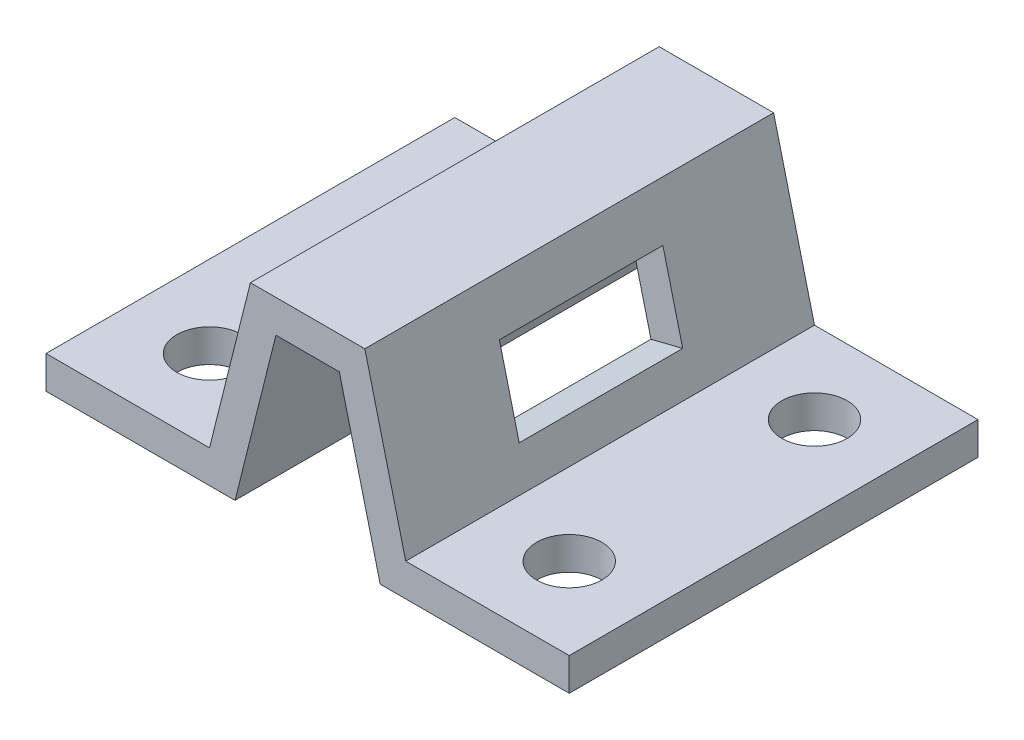
ISO-10303-21;
HEADER;
FILE_DESCRIPTION(('STEP AP214'),'2;1');
FILE_NAME('part.step','',(''),(''),'','','');
FILE_SCHEMA(('AUTOMOTIVE_DESIGN { 1 0 10303 214 1 1 1 1 }'));
ENDSEC;
DATA;
#1=APPLICATION_CONTEXT('core data for automotive mechanical design processes');
#2=APPLICATION_PROTOCOL_DEFINITION('international standard','automotive_design',2000,#1);
#3=PRODUCT_CONTEXT('',#1,'mechanical');
#4=PRODUCT('Part','Part','',(#3));
#5=PRODUCT_RELATED_PRODUCT_CATEGORY('part','',(#4));
#6=PRODUCT_DEFINITION_FORMATION('','',#4);
#7=PRODUCT_DEFINITION_CONTEXT('part definition',#1,'design');
#8=PRODUCT_DEFINITION('design','',#6,#7);
#9=PRODUCT_DEFINITION_SHAPE('','',#8);
#10=(LENGTH_UNIT() NAMED_UNIT(*) SI_UNIT(.MILLI.,.METRE.));
#11=(NAMED_UNIT(*) PLANE_ANGLE_UNIT() SI_UNIT($,.RADIAN.));
#12=(NAMED_UNIT(*) SI_UNIT($,.STERADIAN.) SOLID_ANGLE_UNIT());
#13=UNCERTAINTY_MEASURE_WITH_UNIT(LENGTH_MEASURE(1.E-05),#10,'distance_accuracy_value','');
#14=(GEOMETRIC_REPRESENTATION_CONTEXT(3) GLOBAL_UNCERTAINTY_ASSIGNED_CONTEXT((#13)) GLOBAL_UNIT_ASSIGNED_CONTEXT((#10,
#11,#12)) REPRESENTATION_CONTEXT('',''));
#15=CARTESIAN_POINT('',(0.,0.,0.));
#16=DIRECTION('',(0.,0.,1.));
#17=DIRECTION('',(1.,0.,0.));
#18=AXIS2_PLACEMENT_3D('',#15,#16,#17);
#19=CARTESIAN_POINT('',(-30.,9.99999999999998,62.5));
#20=DIRECTION('',(0.970142500145332,-0.242535625036333,0.));
#21=DIRECTION('',(0.242535625036333,0.970142500145332,0.));
#22=AXIS2_PLACEMENT_3D('',#19,#20,#21);
#23=PLANE('',#22);
#24=DIRECTION('',(0.,0.,-1.));
#25=VECTOR('',#24,1.);
#26=CARTESIAN_POINT('',(-21.138034375545,45.44786249782,-25.));
#27=LINE('',#26,#25);
#28=CARTESIAN_POINT('',(-21.138034375545,45.44786249782,25.));
#29=VERTEX_POINT('',#28);
#30=CARTESIAN_POINT('',(-21.138034375545,45.44786249782,-25.));
#31=VERTEX_POINT('',#30);
#32=EDGE_CURVE('E198',#29,#31,#27,.T.);
#33=ORIENTED_EDGE('',*,*,#32,.F.);
#34=DIRECTION('',(0.242535625036333,0.970142500145332,0.));
#35=VECTOR('',#34,1.);
#36=CARTESIAN_POINT('',(-21.138034375545,45.44786249782,25.));
#37=LINE('',#36,#35);
#38=CARTESIAN_POINT('',(-27.2014250014533,21.1942999941867,25.));
#39=VERTEX_POINT('',#38);
#40=EDGE_CURVE('E49',#39,#29,#37,.T.);
#41=ORIENTED_EDGE('',*,*,#40,.F.);
#42=DIRECTION('',(0.,0.,1.));
#43=VECTOR('',#42,1.);
#44=CARTESIAN_POINT('',(-27.2014250014533,21.1942999941867,-25.));
#45=LINE('',#44,#43);
#46=CARTESIAN_POINT('',(-27.2014250014533,21.1942999941867,-25.));
#47=VERTEX_POINT('',#46);
#48=EDGE_CURVE('E189',#47,#39,#45,.T.);
#49=ORIENTED_EDGE('',*,*,#48,.F.);
#50=DIRECTION('',(-0.242535625036333,-0.970142500145332,0.));
#51=VECTOR('',#50,1.);
#52=CARTESIAN_POINT('',(-21.138034375545,45.44786249782,-25.));
#53=LINE('',#52,#51);
#54=EDGE_CURVE('E192',#31,#47,#53,.T.);
#55=ORIENTED_EDGE('',*,*,#54,.F.);
#56=EDGE_LOOP('',(#33,#41,#49,#55));
#57=FACE_BOUND('',#56,.T.);
#58=DIRECTION('',(-0.242535625036333,-0.970142500145332,0.));
#59=VECTOR('',#58,1.);
#60=CARTESIAN_POINT('',(-30.,9.99999999999998,-62.5));
#61=LINE('',#60,#59);
#62=CARTESIAN_POINT('',(-17.5,60.,-62.5));
#63=VERTEX_POINT('',#62);
#64=CARTESIAN_POINT('',(-30.,9.99999999999998,-62.5));
#65=VERTEX_POINT('',#64);
#66=EDGE_CURVE('E258',#63,#65,#61,.T.);
#67=ORIENTED_EDGE('',*,*,#66,.T.);
#68=DIRECTION('',(0.,0.,-1.));
#69=VECTOR('',#68,1.);
#70=CARTESIAN_POINT('',(-30.,9.99999999999998,62.5));
#71=LINE('',#70,#69);
#72=CARTESIAN_POINT('',(-30.,9.99999999999998,62.5));
#73=VERTEX_POINT('',#72);
#74=EDGE_CURVE('E11',#73,#65,#71,.T.);
#75=ORIENTED_EDGE('',*,*,#74,.F.);
#76=DIRECTION('',(-0.242535625036333,-0.970142500145332,0.));
#77=VECTOR('',#76,1.);
#78=CARTESIAN_POINT('',(-30.,9.99999999999998,62.5));
#79=LINE('',#78,#77);
#80=CARTESIAN_POINT('',(-17.5,60.,62.5));
#81=VERTEX_POINT('',#80);
#82=EDGE_CURVE('E259',#81,#73,#79,.T.);
#83=ORIENTED_EDGE('',*,*,#82,.F.);
#84=DIRECTION('',(0.,0.,-1.));
#85=VECTOR('',#84,1.);
#86=CARTESIAN_POINT('',(-17.5,60.,62.5));
#87=LINE('',#86,#85);
#88=EDGE_CURVE('E285',#81,#63,#87,.T.);
#89=ORIENTED_EDGE('',*,*,#88,.T.);
#90=EDGE_LOOP('',(#67,#75,#83,#89));
#91=FACE_BOUND('',#90,.T.);
#92=ADVANCED_FACE('F33',(#57,#91),#23,.F.);
#93=CARTESIAN_POINT('',(-80.,10.,62.5));
#94=DIRECTION('',(0.,-1.,0.));
#95=DIRECTION('',(1.,0.,0.));
#96=AXIS2_PLACEMENT_3D('',#93,#94,#95);
#97=PLANE('',#96);
#98=CARTESIAN_POINT('',(-55.,9.99999999999997,-37.4999999999992));
#99=DIRECTION('',(0.,1.,0.));
#100=DIRECTION('',(-1.,0.,0.));
#101=AXIS2_PLACEMENT_3D('',#98,#99,#100);
#102=CIRCLE('',#101,9.99999999999999);
#103=CARTESIAN_POINT('',(-65.,9.99999999999997,-37.4999999999992));
#104=VERTEX_POINT('',#103);
#105=EDGE_CURVE('E240',#104,#104,#102,.T.);
#106=ORIENTED_EDGE('',*,*,#105,.F.);
#107=EDGE_LOOP('',(#106));
#108=FACE_BOUND('',#107,.T.);
#109=CARTESIAN_POINT('',(-55.,9.99999999999997,37.5000000000008));
#110=DIRECTION('',(0.,1.,0.));
#111=DIRECTION('',(-1.,0.,0.));
#112=AXIS2_PLACEMENT_3D('',#109,#110,#111);
#113=CIRCLE('',#112,9.99999999999999);
#114=CARTESIAN_POINT('',(-65.,9.99999999999997,37.5000000000008));
#115=VERTEX_POINT('',#114);
#116=EDGE_CURVE('E233',#115,#115,#113,.T.);
#117=ORIENTED_EDGE('',*,*,#116,.F.);
#118=EDGE_LOOP('',(#117));
#119=FACE_BOUND('',#118,.T.);
#120=DIRECTION('',(-1.,0.,0.));
#121=VECTOR('',#120,1.);
#122=CARTESIAN_POINT('',(-80.,10.,-62.5));
#123=LINE('',#122,#121);
#124=CARTESIAN_POINT('',(-80.,10.,-62.5));
#125=VERTEX_POINT('',#124);
#126=EDGE_CURVE('E288',#65,#125,#123,.T.);
#127=ORIENTED_EDGE('',*,*,#126,.T.);
#128=DIRECTION('',(0.,0.,-1.));
#129=VECTOR('',#128,1.);
#130=CARTESIAN_POINT('',(-80.,10.,62.5));
#131=LINE('',#130,#129);
#132=CARTESIAN_POINT('',(-80.,10.,62.5));
#133=VERTEX_POINT('',#132);
#134=EDGE_CURVE('E41',#133,#125,#131,.T.);
#135=ORIENTED_EDGE('',*,*,#134,.F.);
#136=DIRECTION('',(-1.,0.,0.));
#137=VECTOR('',#136,1.);
#138=CARTESIAN_POINT('',(-80.,10.,62.5));
#139=LINE('',#138,#137);
#140=EDGE_CURVE('E262',#73,#133,#139,.T.);
#141=ORIENTED_EDGE('',*,*,#140,.F.);
#142=ORIENTED_EDGE('',*,*,#74,.T.);
#143=EDGE_LOOP('',(#127,#135,#141,#142));
#144=FACE_BOUND('',#143,.T.);
#145=ADVANCED_FACE('F366',(#108,#119,#144),#97,.F.);
#146=CARTESIAN_POINT('',(-80.,10.,62.5));
#147=DIRECTION('',(1.,0.,0.));
#148=DIRECTION('',(0.,0.,-1.));
#149=AXIS2_PLACEMENT_3D('',#146,#147,#148);
#150=PLANE('',#149);
#151=DIRECTION('',(0.,-1.,0.));
#152=VECTOR('',#151,1.);
#153=CARTESIAN_POINT('',(-80.,10.,-62.5));
#154=LINE('',#153,#152);
#155=CARTESIAN_POINT('',(-80.,0.,-62.5));
#156=VERTEX_POINT('',#155);
#157=EDGE_CURVE('E290',#125,#156,#154,.T.);
#158=ORIENTED_EDGE('',*,*,#157,.T.);
#159=DIRECTION('',(0.,0.,-1.));
#160=VECTOR('',#159,1.);
#161=CARTESIAN_POINT('',(-80.,0.,62.5));
#162=LINE('',#161,#160);
#163=CARTESIAN_POINT('',(-80.,0.,62.5));
#164=VERTEX_POINT('',#163);
#165=EDGE_CURVE('E336',#164,#156,#162,.T.);
#166=ORIENTED_EDGE('',*,*,#165,.F.);
#167=DIRECTION('',(0.,-1.,0.));
#168=VECTOR('',#167,1.);
#169=CARTESIAN_POINT('',(-80.,10.,62.5));
#170=LINE('',#169,#168);
#171=EDGE_CURVE('E265',#133,#164,#170,.T.);
#172=ORIENTED_EDGE('',*,*,#171,.F.);
#173=ORIENTED_EDGE('',*,*,#134,.T.);
#174=EDGE_LOOP('',(#158,#166,#172,#173));
#175=FACE_BOUND('',#174,.T.);
#176=ADVANCED_FACE('F371',(#175),#150,.F.);
#177=CARTESIAN_POINT('',(-80.,0.,62.5));
#178=DIRECTION('',(0.,1.,0.));
#179=DIRECTION('',(-1.,0.,0.));
#180=AXIS2_PLACEMENT_3D('',#177,#178,#179);
#181=PLANE('',#180);
#182=CARTESIAN_POINT('',(-55.,0.,-37.4999999999992));
#183=DIRECTION('',(0.,1.,0.));
#184=DIRECTION('',(-1.,0.,0.));
#185=AXIS2_PLACEMENT_3D('',#182,#183,#184);
#186=CIRCLE('',#185,9.99999999999999);
#187=CARTESIAN_POINT('',(-65.,0.,-37.4999999999992));
#188=VERTEX_POINT('',#187);
#189=EDGE_CURVE('E36',#188,#188,#186,.T.);
#190=ORIENTED_EDGE('',*,*,#189,.T.);
#191=EDGE_LOOP('',(#190));
#192=FACE_BOUND('',#191,.T.);
#193=CARTESIAN_POINT('',(-55.,0.,37.5000000000008));
#194=DIRECTION('',(0.,1.,0.));
#195=DIRECTION('',(-1.,0.,0.));
#196=AXIS2_PLACEMENT_3D('',#193,#194,#195);
#197=CIRCLE('',#196,9.99999999999999);
#198=CARTESIAN_POINT('',(-65.,0.,37.5000000000008));
#199=VERTEX_POINT('',#198);
#200=EDGE_CURVE('E251',#199,#199,#197,.T.);
#201=ORIENTED_EDGE('',*,*,#200,.T.);
#202=EDGE_LOOP('',(#201));
#203=FACE_BOUND('',#202,.T.);
#204=DIRECTION('',(1.,0.,0.));
#205=VECTOR('',#204,1.);
#206=CARTESIAN_POINT('',(-80.,0.,-62.5));
#207=LINE('',#206,#205);
#208=CARTESIAN_POINT('',(-22.1922359359559,0.,-62.5));
#209=VERTEX_POINT('',#208);
#210=EDGE_CURVE('E292',#156,#209,#207,.T.);
#211=ORIENTED_EDGE('',*,*,#210,.T.);
#212=DIRECTION('',(0.,0.,-1.));
#213=VECTOR('',#212,1.);
#214=CARTESIAN_POINT('',(-22.1922359359559,0.,62.5));
#215=LINE('',#214,#213);
#216=CARTESIAN_POINT('',(-22.1922359359559,0.,62.5));
#217=VERTEX_POINT('',#216);
#218=EDGE_CURVE('E333',#217,#209,#215,.T.);
#219=ORIENTED_EDGE('',*,*,#218,.F.);
#220=DIRECTION('',(1.,0.,0.));
#221=VECTOR('',#220,1.);
#222=CARTESIAN_POINT('',(-80.,0.,62.5));
#223=LINE('',#222,#221);
#224=EDGE_CURVE('E267',#164,#217,#223,.T.);
#225=ORIENTED_EDGE('',*,*,#224,.F.);
#226=ORIENTED_EDGE('',*,*,#165,.T.);
#227=EDGE_LOOP('',(#211,#219,#225,#226));
#228=FACE_BOUND('',#227,.T.);
#229=ADVANCED_FACE('F346',(#192,#203,#228),#181,.F.);
#230=CARTESIAN_POINT('',(-22.1922359359559,0.,62.5));
#231=DIRECTION('',(-0.970142500145332,0.242535625036333,0.));
#232=DIRECTION('',(-0.242535625036333,-0.970142500145332,0.));
#233=AXIS2_PLACEMENT_3D('',#230,#231,#232);
#234=PLANE('',#233);
#235=DIRECTION('',(0.,0.,1.));
#236=VECTOR('',#235,1.);
#237=CARTESIAN_POINT('',(-17.5,18.7689437438234,-25.));
#238=LINE('',#237,#236);
#239=CARTESIAN_POINT('',(-17.5,18.7689437438234,-25.));
#240=VERTEX_POINT('',#239);
#241=CARTESIAN_POINT('',(-17.5,18.7689437438234,25.));
#242=VERTEX_POINT('',#241);
#243=EDGE_CURVE('E179',#240,#242,#238,.T.);
#244=ORIENTED_EDGE('',*,*,#243,.T.);
#245=DIRECTION('',(0.242535625036333,0.970142500145332,0.));
#246=VECTOR('',#245,1.);
#247=CARTESIAN_POINT('',(-11.4366093740917,43.0225062474567,25.));
#248=LINE('',#247,#246);
#249=CARTESIAN_POINT('',(-11.4366093740917,43.0225062474567,25.));
#250=VERTEX_POINT('',#249);
#251=EDGE_CURVE('E173',#242,#250,#248,.T.);
#252=ORIENTED_EDGE('',*,*,#251,.T.);
#253=DIRECTION('',(0.,0.,-1.));
#254=VECTOR('',#253,1.);
#255=CARTESIAN_POINT('',(-11.4366093740917,43.0225062474567,-25.));
#256=LINE('',#255,#254);
#257=CARTESIAN_POINT('',(-11.4366093740917,43.0225062474567,-25.));
#258=VERTEX_POINT('',#257);
#259=EDGE_CURVE('E182',#250,#258,#256,.T.);
#260=ORIENTED_EDGE('',*,*,#259,.T.);
#261=DIRECTION('',(-0.242535625036333,-0.970142500145332,0.));
#262=VECTOR('',#261,1.);
#263=CARTESIAN_POINT('',(-11.4366093740917,43.0225062474567,-25.));
#264=LINE('',#263,#262);
#265=EDGE_CURVE('E57',#258,#240,#264,.T.);
#266=ORIENTED_EDGE('',*,*,#265,.T.);
#267=EDGE_LOOP('',(#244,#252,#260,#266));
#268=FACE_BOUND('',#267,.T.);
#269=DIRECTION('',(0.242535625036333,0.970142500145332,0.));
#270=VECTOR('',#269,1.);
#271=CARTESIAN_POINT('',(-22.1922359359559,0.,-62.5));
#272=LINE('',#271,#270);
#273=CARTESIAN_POINT('',(-9.69223593595585,50.,-62.5));
#274=VERTEX_POINT('',#273);
#275=EDGE_CURVE('E294',#209,#274,#272,.T.);
#276=ORIENTED_EDGE('',*,*,#275,.T.);
#277=DIRECTION('',(0.,0.,-1.));
#278=VECTOR('',#277,1.);
#279=CARTESIAN_POINT('',(-9.69223593595585,50.,62.5));
#280=LINE('',#279,#278);
#281=CARTESIAN_POINT('',(-9.69223593595585,50.,62.5));
#282=VERTEX_POINT('',#281);
#283=EDGE_CURVE('E330',#282,#274,#280,.T.);
#284=ORIENTED_EDGE('',*,*,#283,.F.);
#285=DIRECTION('',(0.242535625036333,0.970142500145332,0.));
#286=VECTOR('',#285,1.);
#287=CARTESIAN_POINT('',(-22.1922359359559,0.,62.5));
#288=LINE('',#287,#286);
#289=EDGE_CURVE('E269',#217,#282,#288,.T.);
#290=ORIENTED_EDGE('',*,*,#289,.F.);
#291=ORIENTED_EDGE('',*,*,#218,.T.);
#292=EDGE_LOOP('',(#276,#284,#290,#291));
#293=FACE_BOUND('',#292,.T.);
#294=ADVANCED_FACE('F186',(#268,#293),#234,.F.);
#295=CARTESIAN_POINT('',(9.69223593595585,50.,62.5));
#296=DIRECTION('',(0.,1.,0.));
#297=DIRECTION('',(-1.,0.,0.));
#298=AXIS2_PLACEMENT_3D('',#295,#296,#297);
#299=PLANE('',#298);
#300=DIRECTION('',(1.,0.,0.));
#301=VECTOR('',#300,1.);
#302=CARTESIAN_POINT('',(9.69223593595585,50.,-62.5));
#303=LINE('',#302,#301);
#304=CARTESIAN_POINT('',(9.69223593595585,50.,-62.5));
#305=VERTEX_POINT('',#304);
#306=EDGE_CURVE('E297',#274,#305,#303,.T.);
#307=ORIENTED_EDGE('',*,*,#306,.T.);
#308=DIRECTION('',(0.,0.,-1.));
#309=VECTOR('',#308,1.);
#310=CARTESIAN_POINT('',(9.69223593595585,50.,62.5));
#311=LINE('',#310,#309);
#312=CARTESIAN_POINT('',(9.69223593595585,50.,62.5));
#313=VERTEX_POINT('',#312);
#314=EDGE_CURVE('E327',#313,#305,#311,.T.);
#315=ORIENTED_EDGE('',*,*,#314,.F.);
#316=DIRECTION('',(1.,0.,0.));
#317=VECTOR('',#316,1.);
#318=CARTESIAN_POINT('',(-9.69223593595585,50.,62.5));
#319=LINE('',#318,#317);
#320=EDGE_CURVE('E271',#282,#313,#319,.T.);
#321=ORIENTED_EDGE('',*,*,#320,.F.);
#322=ORIENTED_EDGE('',*,*,#283,.T.);
#323=EDGE_LOOP('',(#307,#315,#321,#322));
#324=FACE_BOUND('',#323,.T.);
#325=ADVANCED_FACE('F421',(#324),#299,.F.);
#326=CARTESIAN_POINT('',(22.1922359359559,0.,62.5));
#327=DIRECTION('',(0.970142500145332,0.242535625036334,0.));
#328=DIRECTION('',(-0.242535625036334,0.970142500145332,0.));
#329=AXIS2_PLACEMENT_3D('',#326,#327,#328);
#330=PLANE('',#329);
#331=DIRECTION('',(0.,0.,-1.));
#332=VECTOR('',#331,1.);
#333=CARTESIAN_POINT('',(17.5,18.7689437438234,25.));
#334=LINE('',#333,#332);
#335=CARTESIAN_POINT('',(17.5,18.7689437438234,25.));
#336=VERTEX_POINT('',#335);
#337=CARTESIAN_POINT('',(17.5,18.7689437438234,-25.));
#338=VERTEX_POINT('',#337);
#339=EDGE_CURVE('E218',#336,#338,#334,.T.);
#340=ORIENTED_EDGE('',*,*,#339,.T.);
#341=DIRECTION('',(-0.242535625036334,0.970142500145332,0.));
#342=VECTOR('',#341,1.);
#343=CARTESIAN_POINT('',(11.4366093740917,43.0225062474567,-25.));
#344=LINE('',#343,#342);
#345=CARTESIAN_POINT('',(11.4366093740917,43.0225062474567,-25.));
#346=VERTEX_POINT('',#345);
#347=EDGE_CURVE('E208',#338,#346,#344,.T.);
#348=ORIENTED_EDGE('',*,*,#347,.T.);
#349=DIRECTION('',(0.,0.,1.));
#350=VECTOR('',#349,1.);
#351=CARTESIAN_POINT('',(11.4366093740917,43.0225062474567,25.));
#352=LINE('',#351,#350);
#353=CARTESIAN_POINT('',(11.4366093740917,43.0225062474567,25.));
#354=VERTEX_POINT('',#353);
#355=EDGE_CURVE('E211',#346,#354,#352,.T.);
#356=ORIENTED_EDGE('',*,*,#355,.T.);
#357=DIRECTION('',(0.242535625036334,-0.970142500145332,0.));
#358=VECTOR('',#357,1.);
#359=CARTESIAN_POINT('',(11.4366093740917,43.0225062474567,25.));
#360=LINE('',#359,#358);
#361=EDGE_CURVE('E215',#354,#336,#360,.T.);
#362=ORIENTED_EDGE('',*,*,#361,.T.);
#363=EDGE_LOOP('',(#340,#348,#356,#362));
#364=FACE_BOUND('',#363,.T.);
#365=DIRECTION('',(0.242535625036334,-0.970142500145332,0.));
#366=VECTOR('',#365,1.);
#367=CARTESIAN_POINT('',(22.1922359359559,0.,-62.5));
#368=LINE('',#367,#366);
#369=CARTESIAN_POINT('',(22.1922359359559,0.,-62.5));
#370=VERTEX_POINT('',#369);
#371=EDGE_CURVE('E299',#305,#370,#368,.T.);
#372=ORIENTED_EDGE('',*,*,#371,.T.);
#373=DIRECTION('',(0.,0.,-1.));
#374=VECTOR('',#373,1.);
#375=CARTESIAN_POINT('',(22.1922359359559,0.,62.5));
#376=LINE('',#375,#374);
#377=CARTESIAN_POINT('',(22.1922359359559,0.,62.5));
#378=VERTEX_POINT('',#377);
#379=EDGE_CURVE('E324',#378,#370,#376,.T.);
#380=ORIENTED_EDGE('',*,*,#379,.F.);
#381=DIRECTION('',(0.242535625036334,-0.970142500145332,0.));
#382=VECTOR('',#381,1.);
#383=CARTESIAN_POINT('',(22.1922359359559,0.,62.5));
#384=LINE('',#383,#382);
#385=EDGE_CURVE('E273',#313,#378,#384,.T.);
#386=ORIENTED_EDGE('',*,*,#385,.F.);
#387=ORIENTED_EDGE('',*,*,#314,.T.);
#388=EDGE_LOOP('',(#372,#380,#386,#387));
#389=FACE_BOUND('',#388,.T.);
#390=ADVANCED_FACE('F416',(#364,#389),#330,.F.);
#391=CARTESIAN_POINT('',(80.,0.,62.5));
#392=DIRECTION('',(0.,1.,0.));
#393=DIRECTION('',(-1.,0.,0.));
#394=AXIS2_PLACEMENT_3D('',#391,#392,#393);
#395=PLANE('',#394);
#396=CARTESIAN_POINT('',(55.,0.,37.5));
#397=DIRECTION('',(0.,1.,0.));
#398=DIRECTION('',(-1.,0.,0.));
#399=AXIS2_PLACEMENT_3D('',#396,#397,#398);
#400=CIRCLE('',#399,9.99999999999999);
#401=CARTESIAN_POINT('',(45.,0.,37.5));
#402=VERTEX_POINT('',#401);
#403=EDGE_CURVE('E243',#402,#402,#400,.T.);
#404=ORIENTED_EDGE('',*,*,#403,.T.);
#405=EDGE_LOOP('',(#404));
#406=FACE_BOUND('',#405,.T.);
#407=CARTESIAN_POINT('',(55.,0.,-37.5));
#408=DIRECTION('',(0.,1.,0.));
#409=DIRECTION('',(-1.,0.,0.));
#410=AXIS2_PLACEMENT_3D('',#407,#408,#409);
#411=CIRCLE('',#410,9.99999999999999);
#412=CARTESIAN_POINT('',(45.,0.,-37.5));
#413=VERTEX_POINT('',#412);
#414=EDGE_CURVE('E255',#413,#413,#411,.T.);
#415=ORIENTED_EDGE('',*,*,#414,.T.);
#416=EDGE_LOOP('',(#415));
#417=FACE_BOUND('',#416,.T.);
#418=DIRECTION('',(1.,0.,0.));
#419=VECTOR('',#418,1.);
#420=CARTESIAN_POINT('',(80.,0.,-62.5));
#421=LINE('',#420,#419);
#422=CARTESIAN_POINT('',(80.,0.,-62.5));
#423=VERTEX_POINT('',#422);
#424=EDGE_CURVE('E301',#370,#423,#421,.T.);
#425=ORIENTED_EDGE('',*,*,#424,.T.);
#426=DIRECTION('',(0.,0.,-1.));
#427=VECTOR('',#426,1.);
#428=CARTESIAN_POINT('',(80.,0.,62.5));
#429=LINE('',#428,#427);
#430=CARTESIAN_POINT('',(80.,0.,62.5));
#431=VERTEX_POINT('',#430);
#432=EDGE_CURVE('E321',#431,#423,#429,.T.);
#433=ORIENTED_EDGE('',*,*,#432,.F.);
#434=DIRECTION('',(1.,0.,0.));
#435=VECTOR('',#434,1.);
#436=CARTESIAN_POINT('',(80.,0.,62.5));
#437=LINE('',#436,#435);
#438=EDGE_CURVE('E275',#378,#431,#437,.T.);
#439=ORIENTED_EDGE('',*,*,#438,.F.);
#440=ORIENTED_EDGE('',*,*,#379,.T.);
#441=EDGE_LOOP('',(#425,#433,#439,#440));
#442=FACE_BOUND('',#441,.T.);
#443=ADVANCED_FACE('F411',(#406,#417,#442),#395,.F.);
#444=CARTESIAN_POINT('',(80.,10.,62.5));
#445=DIRECTION('',(-1.,0.,0.));
#446=DIRECTION('',(0.,0.,1.));
#447=AXIS2_PLACEMENT_3D('',#444,#445,#446);
#448=PLANE('',#447);
#449=DIRECTION('',(0.,1.,0.));
#450=VECTOR('',#449,1.);
#451=CARTESIAN_POINT('',(80.,10.,-62.5));
#452=LINE('',#451,#450);
#453=CARTESIAN_POINT('',(80.,10.,-62.5));
#454=VERTEX_POINT('',#453);
#455=EDGE_CURVE('E303',#423,#454,#452,.T.);
#456=ORIENTED_EDGE('',*,*,#455,.T.);
#457=DIRECTION('',(0.,0.,-1.));
#458=VECTOR('',#457,1.);
#459=CARTESIAN_POINT('',(80.,10.,62.5));
#460=LINE('',#459,#458);
#461=CARTESIAN_POINT('',(80.,10.,62.5));
#462=VERTEX_POINT('',#461);
#463=EDGE_CURVE('E318',#462,#454,#460,.T.);
#464=ORIENTED_EDGE('',*,*,#463,.F.);
#465=DIRECTION('',(0.,1.,0.));
#466=VECTOR('',#465,1.);
#467=CARTESIAN_POINT('',(80.,10.,62.5));
#468=LINE('',#467,#466);
#469=EDGE_CURVE('E277',#431,#462,#468,.T.);
#470=ORIENTED_EDGE('',*,*,#469,.F.);
#471=ORIENTED_EDGE('',*,*,#432,.T.);
#472=EDGE_LOOP('',(#456,#464,#470,#471));
#473=FACE_BOUND('',#472,.T.);
#474=ADVANCED_FACE('F407',(#473),#448,.F.);
#475=CARTESIAN_POINT('',(80.,10.,62.5));
#476=DIRECTION('',(0.,-1.,0.));
#477=DIRECTION('',(1.,0.,0.));
#478=AXIS2_PLACEMENT_3D('',#475,#476,#477);
#479=PLANE('',#478);
#480=CARTESIAN_POINT('',(55.,10.,37.5));
#481=DIRECTION('',(0.,1.,0.));
#482=DIRECTION('',(-1.,0.,0.));
#483=AXIS2_PLACEMENT_3D('',#480,#481,#482);
#484=CIRCLE('',#483,9.99999999999999);
#485=CARTESIAN_POINT('',(45.,9.99999999999999,37.5));
#486=VERTEX_POINT('',#485);
#487=EDGE_CURVE('E244',#486,#486,#484,.T.);
#488=ORIENTED_EDGE('',*,*,#487,.F.);
#489=EDGE_LOOP('',(#488));
#490=FACE_BOUND('',#489,.T.);
#491=CARTESIAN_POINT('',(55.,10.,-37.5));
#492=DIRECTION('',(0.,1.,0.));
#493=DIRECTION('',(-1.,0.,0.));
#494=AXIS2_PLACEMENT_3D('',#491,#492,#493);
#495=CIRCLE('',#494,9.99999999999999);
#496=CARTESIAN_POINT('',(45.,9.99999999999999,-37.5));
#497=VERTEX_POINT('',#496);
#498=EDGE_CURVE('E252',#497,#497,#495,.T.);
#499=ORIENTED_EDGE('',*,*,#498,.F.);
#500=EDGE_LOOP('',(#499));
#501=FACE_BOUND('',#500,.T.);
#502=DIRECTION('',(-1.,0.,0.));
#503=VECTOR('',#502,1.);
#504=CARTESIAN_POINT('',(80.,10.,-62.5));
#505=LINE('',#504,#503);
#506=CARTESIAN_POINT('',(30.,9.99999999999999,-62.5));
#507=VERTEX_POINT('',#506);
#508=EDGE_CURVE('E305',#454,#507,#505,.T.);
#509=ORIENTED_EDGE('',*,*,#508,.T.);
#510=DIRECTION('',(0.,0.,-1.));
#511=VECTOR('',#510,1.);
#512=CARTESIAN_POINT('',(30.,9.99999999999999,62.5));
#513=LINE('',#512,#511);
#514=CARTESIAN_POINT('',(30.,9.99999999999999,62.5));
#515=VERTEX_POINT('',#514);
#516=EDGE_CURVE('E315',#515,#507,#513,.T.);
#517=ORIENTED_EDGE('',*,*,#516,.F.);
#518=DIRECTION('',(-1.,0.,0.));
#519=VECTOR('',#518,1.);
#520=CARTESIAN_POINT('',(80.,10.,62.5));
#521=LINE('',#520,#519);
#522=EDGE_CURVE('E279',#462,#515,#521,.T.);
#523=ORIENTED_EDGE('',*,*,#522,.F.);
#524=ORIENTED_EDGE('',*,*,#463,.T.);
#525=EDGE_LOOP('',(#509,#517,#523,#524));
#526=FACE_BOUND('',#525,.T.);
#527=ADVANCED_FACE('F402',(#490,#501,#526),#479,.F.);
#528=CARTESIAN_POINT('',(30.,9.99999999999999,62.5));
#529=DIRECTION('',(-0.970142500145332,-0.242535625036334,0.));
#530=DIRECTION('',(0.242535625036334,-0.970142500145332,0.));
#531=AXIS2_PLACEMENT_3D('',#528,#529,#530);
#532=PLANE('',#531);
#533=DIRECTION('',(0.,0.,1.));
#534=VECTOR('',#533,1.);
#535=CARTESIAN_POINT('',(21.138034375545,45.44786249782,25.));
#536=LINE('',#535,#534);
#537=CARTESIAN_POINT('',(21.138034375545,45.44786249782,-25.));
#538=VERTEX_POINT('',#537);
#539=CARTESIAN_POINT('',(21.138034375545,45.44786249782,25.));
#540=VERTEX_POINT('',#539);
#541=EDGE_CURVE('E223',#538,#540,#536,.T.);
#542=ORIENTED_EDGE('',*,*,#541,.F.);
#543=DIRECTION('',(-0.242535625036334,0.970142500145332,0.));
#544=VECTOR('',#543,1.);
#545=CARTESIAN_POINT('',(21.138034375545,45.44786249782,-25.));
#546=LINE('',#545,#544);
#547=CARTESIAN_POINT('',(27.2014250014534,21.1942999941867,-25.));
#548=VERTEX_POINT('',#547);
#549=EDGE_CURVE('E204',#548,#538,#546,.T.);
#550=ORIENTED_EDGE('',*,*,#549,.F.);
#551=DIRECTION('',(0.,0.,-1.));
#552=VECTOR('',#551,1.);
#553=CARTESIAN_POINT('',(27.2014250014534,21.1942999941867,25.));
#554=LINE('',#553,#552);
#555=CARTESIAN_POINT('',(27.2014250014534,21.1942999941867,25.));
#556=VERTEX_POINT('',#555);
#557=EDGE_CURVE('E212',#556,#548,#554,.T.);
#558=ORIENTED_EDGE('',*,*,#557,.F.);
#559=DIRECTION('',(0.242535625036334,-0.970142500145332,0.));
#560=VECTOR('',#559,1.);
#561=CARTESIAN_POINT('',(21.138034375545,45.44786249782,25.));
#562=LINE('',#561,#560);
#563=EDGE_CURVE('E226',#540,#556,#562,.T.);
#564=ORIENTED_EDGE('',*,*,#563,.F.);
#565=EDGE_LOOP('',(#542,#550,#558,#564));
#566=FACE_BOUND('',#565,.T.);
#567=DIRECTION('',(-0.242535625036334,0.970142500145332,0.));
#568=VECTOR('',#567,1.);
#569=CARTESIAN_POINT('',(30.,9.99999999999999,-62.5));
#570=LINE('',#569,#568);
#571=CARTESIAN_POINT('',(17.5,60.,-62.5));
#572=VERTEX_POINT('',#571);
#573=EDGE_CURVE('E307',#507,#572,#570,.T.);
#574=ORIENTED_EDGE('',*,*,#573,.T.);
#575=DIRECTION('',(0.,0.,-1.));
#576=VECTOR('',#575,1.);
#577=CARTESIAN_POINT('',(17.5,60.,62.5));
#578=LINE('',#577,#576);
#579=CARTESIAN_POINT('',(17.5,60.,62.5));
#580=VERTEX_POINT('',#579);
#581=EDGE_CURVE('E312',#580,#572,#578,.T.);
#582=ORIENTED_EDGE('',*,*,#581,.F.);
#583=DIRECTION('',(-0.242535625036334,0.970142500145332,0.));
#584=VECTOR('',#583,1.);
#585=CARTESIAN_POINT('',(30.,9.99999999999999,62.5));
#586=LINE('',#585,#584);
#587=EDGE_CURVE('E281',#515,#580,#586,.T.);
#588=ORIENTED_EDGE('',*,*,#587,.F.);
#589=ORIENTED_EDGE('',*,*,#516,.T.);
#590=EDGE_LOOP('',(#574,#582,#588,#589));
#591=FACE_BOUND('',#590,.T.);
#592=ADVANCED_FACE('F396',(#566,#591),#532,.F.);
#593=CARTESIAN_POINT('',(-17.5,60.,62.5));
#594=DIRECTION('',(0.,-1.,0.));
#595=DIRECTION('',(0.,0.,-1.));
#596=AXIS2_PLACEMENT_3D('',#593,#594,#595);
#597=PLANE('',#596);
#598=DIRECTION('',(-1.,0.,0.));
#599=VECTOR('',#598,1.);
#600=CARTESIAN_POINT('',(-17.5,60.,-62.5));
#601=LINE('',#600,#599);
#602=EDGE_CURVE('E263',#572,#63,#601,.T.);
#603=ORIENTED_EDGE('',*,*,#602,.T.);
#604=ORIENTED_EDGE('',*,*,#88,.F.);
#605=DIRECTION('',(-1.,0.,0.));
#606=VECTOR('',#605,1.);
#607=CARTESIAN_POINT('',(-17.5,60.,62.5));
#608=LINE('',#607,#606);
#609=EDGE_CURVE('E283',#580,#81,#608,.T.);
#610=ORIENTED_EDGE('',*,*,#609,.F.);
#611=ORIENTED_EDGE('',*,*,#581,.T.);
#612=EDGE_LOOP('',(#603,#604,#610,#611));
#613=FACE_BOUND('',#612,.T.);
#614=ADVANCED_FACE('F394',(#613),#597,.F.);
#615=CARTESIAN_POINT('',(0.,0.,62.5));
#616=DIRECTION('',(0.,0.,-1.));
#617=DIRECTION('',(-1.,0.,0.));
#618=AXIS2_PLACEMENT_3D('',#615,#616,#617);
#619=PLANE('',#618);
#620=ORIENTED_EDGE('',*,*,#82,.T.);
#621=ORIENTED_EDGE('',*,*,#140,.T.);
#622=ORIENTED_EDGE('',*,*,#171,.T.);
#623=ORIENTED_EDGE('',*,*,#224,.T.);
#624=ORIENTED_EDGE('',*,*,#289,.T.);
#625=ORIENTED_EDGE('',*,*,#320,.T.);
#626=ORIENTED_EDGE('',*,*,#385,.T.);
#627=ORIENTED_EDGE('',*,*,#438,.T.);
#628=ORIENTED_EDGE('',*,*,#469,.T.);
#629=ORIENTED_EDGE('',*,*,#522,.T.);
#630=ORIENTED_EDGE('',*,*,#587,.T.);
#631=ORIENTED_EDGE('',*,*,#609,.T.);
#632=EDGE_LOOP('',(#620,#621,#622,#623,#624,#625,#626,#627,#628,#629,#630,#631));
#633=FACE_BOUND('',#632,.T.);
#634=ADVANCED_FACE('F389',(#633),#619,.F.);
#635=CARTESIAN_POINT('',(0.,0.,-62.5));
#636=DIRECTION('',(0.,0.,-1.));
#637=DIRECTION('',(-1.,0.,0.));
#638=AXIS2_PLACEMENT_3D('',#635,#636,#637);
#639=PLANE('',#638);
#640=ORIENTED_EDGE('',*,*,#66,.F.);
#641=ORIENTED_EDGE('',*,*,#602,.F.);
#642=ORIENTED_EDGE('',*,*,#573,.F.);
#643=ORIENTED_EDGE('',*,*,#508,.F.);
#644=ORIENTED_EDGE('',*,*,#455,.F.);
#645=ORIENTED_EDGE('',*,*,#424,.F.);
#646=ORIENTED_EDGE('',*,*,#371,.F.);
#647=ORIENTED_EDGE('',*,*,#306,.F.);
#648=ORIENTED_EDGE('',*,*,#275,.F.);
#649=ORIENTED_EDGE('',*,*,#210,.F.);
#650=ORIENTED_EDGE('',*,*,#157,.F.);
#651=ORIENTED_EDGE('',*,*,#126,.F.);
#652=EDGE_LOOP('',(#640,#641,#642,#643,#644,#645,#646,#647,#648,#649,#650,#651));
#653=FACE_BOUND('',#652,.T.);
#654=ADVANCED_FACE('F381',(#653),#639,.T.);
#655=CARTESIAN_POINT('',(55.,-115.,-37.5));
#656=DIRECTION('',(0.,1.,0.));
#657=DIRECTION('',(-1.,0.,0.));
#658=AXIS2_PLACEMENT_3D('',#655,#656,#657);
#659=CYLINDRICAL_SURFACE('',#658,9.99999999999999);
#660=ORIENTED_EDGE('',*,*,#498,.T.);
#661=EDGE_LOOP('',(#660));
#662=FACE_BOUND('',#661,.T.);
#663=ORIENTED_EDGE('',*,*,#414,.F.);
#664=EDGE_LOOP('',(#663));
#665=FACE_BOUND('',#664,.T.);
#666=ADVANCED_FACE('F458',(#662,#665),#659,.F.);
#667=CARTESIAN_POINT('',(55.,-115.,37.5));
#668=DIRECTION('',(0.,1.,0.));
#669=DIRECTION('',(-1.,0.,0.));
#670=AXIS2_PLACEMENT_3D('',#667,#668,#669);
#671=CYLINDRICAL_SURFACE('',#670,9.99999999999999);
#672=ORIENTED_EDGE('',*,*,#487,.T.);
#673=EDGE_LOOP('',(#672));
#674=FACE_BOUND('',#673,.T.);
#675=ORIENTED_EDGE('',*,*,#403,.F.);
#676=EDGE_LOOP('',(#675));
#677=FACE_BOUND('',#676,.T.);
#678=ADVANCED_FACE('F361',(#674,#677),#671,.F.);
#679=CARTESIAN_POINT('',(-55.,-115.,37.5000000000008));
#680=DIRECTION('',(0.,1.,0.));
#681=DIRECTION('',(-1.,0.,0.));
#682=AXIS2_PLACEMENT_3D('',#679,#680,#681);
#683=CYLINDRICAL_SURFACE('',#682,9.99999999999999);
#684=ORIENTED_EDGE('',*,*,#116,.T.);
#685=EDGE_LOOP('',(#684));
#686=FACE_BOUND('',#685,.T.);
#687=ORIENTED_EDGE('',*,*,#200,.F.);
#688=EDGE_LOOP('',(#687));
#689=FACE_BOUND('',#688,.T.);
#690=ADVANCED_FACE('F351',(#686,#689),#683,.F.);
#691=CARTESIAN_POINT('',(-55.,-115.,-37.4999999999992));
#692=DIRECTION('',(0.,1.,0.));
#693=DIRECTION('',(-1.,0.,0.));
#694=AXIS2_PLACEMENT_3D('',#691,#692,#693);
#695=CYLINDRICAL_SURFACE('',#694,9.99999999999999);
#696=ORIENTED_EDGE('',*,*,#105,.T.);
#697=EDGE_LOOP('',(#696));
#698=FACE_BOUND('',#697,.T.);
#699=ORIENTED_EDGE('',*,*,#189,.F.);
#700=EDGE_LOOP('',(#699));
#701=FACE_BOUND('',#700,.T.);
#702=ADVANCED_FACE('F348',(#698,#701),#695,.F.);
#703=CARTESIAN_POINT('',(11.4366093740917,43.0225062474567,-25.));
#704=DIRECTION('',(0.,0.,-1.));
#705=DIRECTION('',(-1.,0.,0.));
#706=AXIS2_PLACEMENT_3D('',#703,#704,#705);
#707=PLANE('',#706);
#708=ORIENTED_EDGE('',*,*,#549,.T.);
#709=DIRECTION('',(0.970142500145332,0.242535625036334,0.));
#710=VECTOR('',#709,1.);
#711=CARTESIAN_POINT('',(11.4366093740917,43.0225062474567,-25.));
#712=LINE('',#711,#710);
#713=EDGE_CURVE('E221',#346,#538,#712,.T.);
#714=ORIENTED_EDGE('',*,*,#713,.F.);
#715=ORIENTED_EDGE('',*,*,#347,.F.);
#716=DIRECTION('',(0.970142500145332,0.242535625036334,0.));
#717=VECTOR('',#716,1.);
#718=CARTESIAN_POINT('',(17.5,18.7689437438234,-25.));
#719=LINE('',#718,#717);
#720=EDGE_CURVE('E231',#338,#548,#719,.T.);
#721=ORIENTED_EDGE('',*,*,#720,.T.);
#722=EDGE_LOOP('',(#708,#714,#715,#721));
#723=FACE_BOUND('',#722,.T.);
#724=ADVANCED_FACE('F350',(#723),#707,.F.);
#725=CARTESIAN_POINT('',(17.5,18.7689437438234,25.));
#726=DIRECTION('',(0.242535625036334,-0.970142500145332,0.));
#727=DIRECTION('',(0.970142500145332,0.242535625036334,0.));
#728=AXIS2_PLACEMENT_3D('',#725,#726,#727);
#729=PLANE('',#728);
#730=ORIENTED_EDGE('',*,*,#557,.T.);
#731=ORIENTED_EDGE('',*,*,#720,.F.);
#732=ORIENTED_EDGE('',*,*,#339,.F.);
#733=DIRECTION('',(0.970142500145332,0.242535625036334,0.));
#734=VECTOR('',#733,1.);
#735=CARTESIAN_POINT('',(17.5,18.7689437438234,25.));
#736=LINE('',#735,#734);
#737=EDGE_CURVE('E234',#336,#556,#736,.T.);
#738=ORIENTED_EDGE('',*,*,#737,.T.);
#739=EDGE_LOOP('',(#730,#731,#732,#738));
#740=FACE_BOUND('',#739,.T.);
#741=ADVANCED_FACE('F358',(#740),#729,.F.);
#742=CARTESIAN_POINT('',(11.4366093740917,43.0225062474567,25.));
#743=DIRECTION('',(0.,0.,1.));
#744=DIRECTION('',(0.,-1.,0.));
#745=AXIS2_PLACEMENT_3D('',#742,#743,#744);
#746=PLANE('',#745);
#747=ORIENTED_EDGE('',*,*,#563,.T.);
#748=ORIENTED_EDGE('',*,*,#737,.F.);
#749=ORIENTED_EDGE('',*,*,#361,.F.);
#750=DIRECTION('',(0.970142500145332,0.242535625036334,0.));
#751=VECTOR('',#750,1.);
#752=CARTESIAN_POINT('',(11.4366093740917,43.0225062474567,25.));
#753=LINE('',#752,#751);
#754=EDGE_CURVE('E236',#354,#540,#753,.T.);
#755=ORIENTED_EDGE('',*,*,#754,.T.);
#756=EDGE_LOOP('',(#747,#748,#749,#755));
#757=FACE_BOUND('',#756,.T.);
#758=ADVANCED_FACE('F516',(#757),#746,.F.);
#759=CARTESIAN_POINT('',(11.4366093740917,43.0225062474567,25.));
#760=DIRECTION('',(-0.242535625036334,0.970142500145332,0.));
#761=DIRECTION('',(-0.970142500145332,-0.242535625036334,0.));
#762=AXIS2_PLACEMENT_3D('',#759,#760,#761);
#763=PLANE('',#762);
#764=ORIENTED_EDGE('',*,*,#541,.T.);
#765=ORIENTED_EDGE('',*,*,#754,.F.);
#766=ORIENTED_EDGE('',*,*,#355,.F.);
#767=ORIENTED_EDGE('',*,*,#713,.T.);
#768=EDGE_LOOP('',(#764,#765,#766,#767));
#769=FACE_BOUND('',#768,.T.);
#770=ADVANCED_FACE('F526',(#769),#763,.F.);
#771=CARTESIAN_POINT('',(-11.4366093740917,43.0225062474567,25.));
#772=DIRECTION('',(0.,0.,1.));
#773=DIRECTION('',(0.,-1.,0.));
#774=AXIS2_PLACEMENT_3D('',#771,#772,#773);
#775=PLANE('',#774);
#776=ORIENTED_EDGE('',*,*,#40,.T.);
#777=DIRECTION('',(-0.970142500145332,0.242535625036333,0.));
#778=VECTOR('',#777,1.);
#779=CARTESIAN_POINT('',(-11.4366093740917,43.0225062474567,25.));
#780=LINE('',#779,#778);
#781=EDGE_CURVE('E169',#250,#29,#780,.T.);
#782=ORIENTED_EDGE('',*,*,#781,.F.);
#783=ORIENTED_EDGE('',*,*,#251,.F.);
#784=DIRECTION('',(-0.970142500145332,0.242535625036333,0.));
#785=VECTOR('',#784,1.);
#786=CARTESIAN_POINT('',(-17.5,18.7689437438234,25.));
#787=LINE('',#786,#785);
#788=EDGE_CURVE('E202',#242,#39,#787,.T.);
#789=ORIENTED_EDGE('',*,*,#788,.T.);
#790=EDGE_LOOP('',(#776,#782,#783,#789));
#791=FACE_BOUND('',#790,.T.);
#792=ADVANCED_FACE('F171',(#791),#775,.F.);
#793=CARTESIAN_POINT('',(-17.5,18.7689437438234,-25.));
#794=DIRECTION('',(-0.242535625036333,-0.970142500145332,0.));
#795=DIRECTION('',(0.970142500145332,-0.242535625036333,0.));
#796=AXIS2_PLACEMENT_3D('',#793,#794,#795);
#797=PLANE('',#796);
#798=ORIENTED_EDGE('',*,*,#48,.T.);
#799=ORIENTED_EDGE('',*,*,#788,.F.);
#800=ORIENTED_EDGE('',*,*,#243,.F.);
#801=DIRECTION('',(-0.970142500145332,0.242535625036333,0.));
#802=VECTOR('',#801,1.);
#803=CARTESIAN_POINT('',(-17.5,18.7689437438234,-25.));
#804=LINE('',#803,#802);
#805=EDGE_CURVE('E205',#240,#47,#804,.T.);
#806=ORIENTED_EDGE('',*,*,#805,.T.);
#807=EDGE_LOOP('',(#798,#799,#800,#806));
#808=FACE_BOUND('',#807,.T.);
#809=ADVANCED_FACE('F558',(#808),#797,.F.);
#810=CARTESIAN_POINT('',(-11.4366093740917,43.0225062474567,-25.));
#811=DIRECTION('',(0.,0.,-1.));
#812=DIRECTION('',(0.,1.,0.));
#813=AXIS2_PLACEMENT_3D('',#810,#811,#812);
#814=PLANE('',#813);
#815=ORIENTED_EDGE('',*,*,#54,.T.);
#816=ORIENTED_EDGE('',*,*,#805,.F.);
#817=ORIENTED_EDGE('',*,*,#265,.F.);
#818=DIRECTION('',(-0.970142500145332,0.242535625036333,0.));
#819=VECTOR('',#818,1.);
#820=CARTESIAN_POINT('',(-11.4366093740917,43.0225062474567,-25.));
#821=LINE('',#820,#819);
#822=EDGE_CURVE('E178',#258,#31,#821,.T.);
#823=ORIENTED_EDGE('',*,*,#822,.T.);
#824=EDGE_LOOP('',(#815,#816,#817,#823));
#825=FACE_BOUND('',#824,.T.);
#826=ADVANCED_FACE('F567',(#825),#814,.F.);
#827=CARTESIAN_POINT('',(-11.4366093740917,43.0225062474567,-25.));
#828=DIRECTION('',(0.242535625036333,0.970142500145332,0.));
#829=DIRECTION('',(-0.970142500145332,0.242535625036333,0.));
#830=AXIS2_PLACEMENT_3D('',#827,#828,#829);
#831=PLANE('',#830);
#832=ORIENTED_EDGE('',*,*,#32,.T.);
#833=ORIENTED_EDGE('',*,*,#822,.F.);
#834=ORIENTED_EDGE('',*,*,#259,.F.);
#835=ORIENTED_EDGE('',*,*,#781,.T.);
#836=EDGE_LOOP('',(#832,#833,#834,#835));
#837=FACE_BOUND('',#836,.T.);
#838=ADVANCED_FACE('F183',(#837),#831,.F.);
#839=CLOSED_SHELL('',(#92,#145,#176,#229,#294,#325,#390,#443,#474,#527,#592,#614,#634,#654,#666,
#678,#690,#702,#724,#741,#758,#770,#792,#809,#826,#838));
#840=MANIFOLD_SOLID_BREP('B2',#839);
#841=ADVANCED_BREP_SHAPE_REPRESENTATION('',(#18,#840),#14);
#842=SHAPE_DEFINITION_REPRESENTATION(#9,#841);
ENDSEC;
END-ISO-10303-21;
